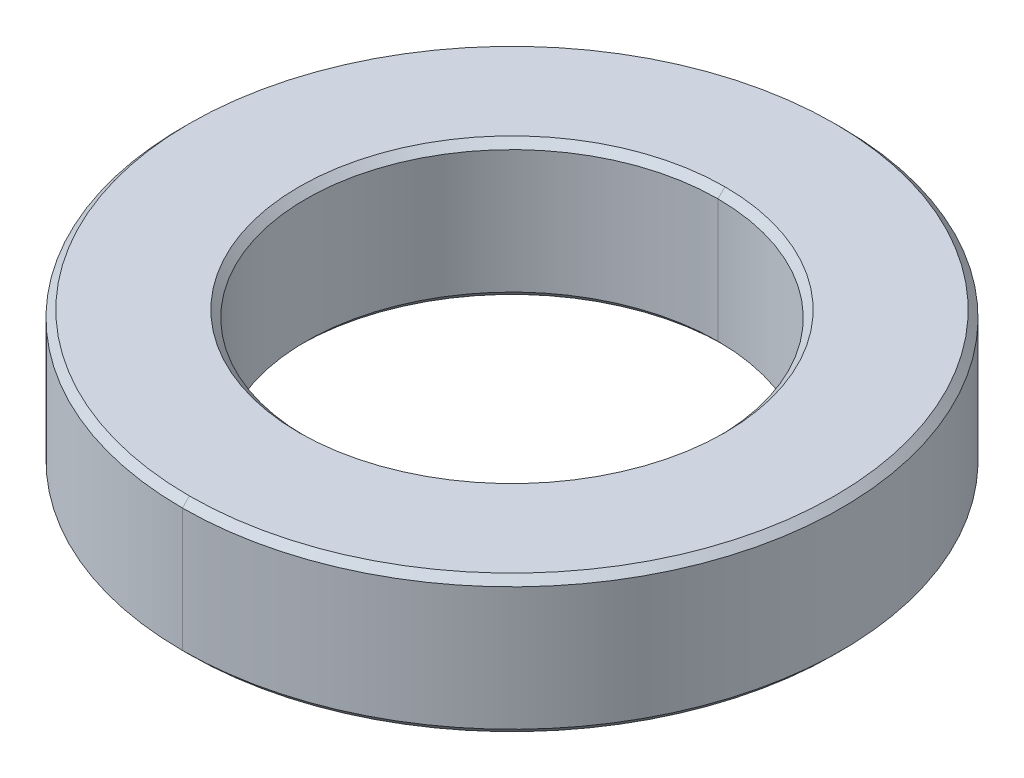
ISO-10303-21;
HEADER;
FILE_DESCRIPTION(('STEP AP214'),'2;1');
FILE_NAME('part.step','',(''),(''),'','','');
FILE_SCHEMA(('AUTOMOTIVE_DESIGN { 1 0 10303 214 1 1 1 1 }'));
ENDSEC;
DATA;
#1=APPLICATION_CONTEXT('core data for automotive mechanical design processes');
#2=APPLICATION_PROTOCOL_DEFINITION('international standard','automotive_design',2000,#1);
#3=PRODUCT_CONTEXT('',#1,'mechanical');
#4=PRODUCT('Part','Part','',(#3));
#5=PRODUCT_RELATED_PRODUCT_CATEGORY('part','',(#4));
#6=PRODUCT_DEFINITION_FORMATION('','',#4);
#7=PRODUCT_DEFINITION_CONTEXT('part definition',#1,'design');
#8=PRODUCT_DEFINITION('design','',#6,#7);
#9=PRODUCT_DEFINITION_SHAPE('','',#8);
#10=(LENGTH_UNIT() NAMED_UNIT(*) SI_UNIT(.MILLI.,.METRE.));
#11=(NAMED_UNIT(*) PLANE_ANGLE_UNIT() SI_UNIT($,.RADIAN.));
#12=(NAMED_UNIT(*) SI_UNIT($,.STERADIAN.) SOLID_ANGLE_UNIT());
#13=UNCERTAINTY_MEASURE_WITH_UNIT(LENGTH_MEASURE(1.E-05),#10,'distance_accuracy_value','');
#14=(GEOMETRIC_REPRESENTATION_CONTEXT(3) GLOBAL_UNCERTAINTY_ASSIGNED_CONTEXT((#13)) GLOBAL_UNIT_ASSIGNED_CONTEXT((#10,
#11,#12)) REPRESENTATION_CONTEXT('',''));
#15=CARTESIAN_POINT('',(0.,0.,0.));
#16=DIRECTION('',(0.,0.,1.));
#17=DIRECTION('',(1.,0.,0.));
#18=AXIS2_PLACEMENT_3D('',#15,#16,#17);
#19=CARTESIAN_POINT('',(0.,2.499999953,0.));
#20=DIRECTION('',(0.,-1.,0.));
#21=DIRECTION('',(0.,0.,-1.));
#22=AXIS2_PLACEMENT_3D('',#19,#20,#21);
#23=CONICAL_SURFACE('',#22,11.746000003,0.785398163397435);
#24=DIRECTION('',(0.,-0.707106781186557,0.707106781186538));
#25=VECTOR('',#24,1.);
#26=CARTESIAN_POINT('',(0.,2.499999953,11.746000003));
#27=LINE('',#26,#25);
#28=CARTESIAN_POINT('',(0.,2.499999953,11.746000003));
#29=VERTEX_POINT('',#28);
#30=CARTESIAN_POINT('',(0.,2.245999953,12.000000003));
#31=VERTEX_POINT('',#30);
#32=EDGE_CURVE('E189',#29,#31,#27,.T.);
#33=ORIENTED_EDGE('',*,*,#32,.F.);
#34=CARTESIAN_POINT('',(0.,2.499999953,0.));
#35=DIRECTION('',(0.,1.,0.));
#36=DIRECTION('',(0.,0.,1.));
#37=AXIS2_PLACEMENT_3D('',#34,#35,#36);
#38=CIRCLE('',#37,11.746000003);
#39=CARTESIAN_POINT('',(0.,2.499999953,-11.746000003));
#40=VERTEX_POINT('',#39);
#41=EDGE_CURVE('E178',#40,#29,#38,.T.);
#42=ORIENTED_EDGE('',*,*,#41,.F.);
#43=DIRECTION('',(0.,-0.707106781186557,-0.707106781186538));
#44=VECTOR('',#43,1.);
#45=CARTESIAN_POINT('',(0.,2.499999953,-11.746000003));
#46=LINE('',#45,#44);
#47=CARTESIAN_POINT('',(0.,2.245999953,-12.000000003));
#48=VERTEX_POINT('',#47);
#49=EDGE_CURVE('E181',#40,#48,#46,.T.);
#50=ORIENTED_EDGE('',*,*,#49,.T.);
#51=CARTESIAN_POINT('',(0.,2.245999953,0.));
#52=DIRECTION('',(0.,-1.,0.));
#53=DIRECTION('',(0.,0.,1.));
#54=AXIS2_PLACEMENT_3D('',#51,#52,#53);
#55=CIRCLE('',#54,12.000000003);
#56=EDGE_CURVE('E110',#31,#48,#55,.T.);
#57=ORIENTED_EDGE('',*,*,#56,.F.);
#58=EDGE_LOOP('',(#33,#42,#50,#57));
#59=FACE_BOUND('',#58,.T.);
#60=ADVANCED_FACE('F16',(#59),#23,.T.);
#61=CARTESIAN_POINT('',(0.,2.24599995299999,0.));
#62=DIRECTION('',(0.,1.,0.));
#63=DIRECTION('',(0.,0.,1.));
#64=AXIS2_PLACEMENT_3D('',#61,#62,#63);
#65=CONICAL_SURFACE('',#64,7.499999986,0.785398163397452);
#66=DIRECTION('',(0.,0.707106781186545,-0.70710678118655));
#67=VECTOR('',#66,1.);
#68=CARTESIAN_POINT('',(0.,2.24599995299999,-7.499999986));
#69=LINE('',#68,#67);
#70=CARTESIAN_POINT('',(0.,2.24599995299999,-7.499999986));
#71=VERTEX_POINT('',#70);
#72=CARTESIAN_POINT('',(0.,2.499999953,-7.75399998600001));
#73=VERTEX_POINT('',#72);
#74=EDGE_CURVE('E203',#71,#73,#69,.T.);
#75=ORIENTED_EDGE('',*,*,#74,.F.);
#76=CARTESIAN_POINT('',(0.,2.24599995299999,0.));
#77=DIRECTION('',(0.,1.,0.));
#78=DIRECTION('',(0.,0.,1.));
#79=AXIS2_PLACEMENT_3D('',#76,#77,#78);
#80=CIRCLE('',#79,7.499999986);
#81=CARTESIAN_POINT('',(0.,2.24599995299999,7.499999986));
#82=VERTEX_POINT('',#81);
#83=EDGE_CURVE('E26',#82,#71,#80,.T.);
#84=ORIENTED_EDGE('',*,*,#83,.F.);
#85=DIRECTION('',(0.,0.707106781186545,0.70710678118655));
#86=VECTOR('',#85,1.);
#87=CARTESIAN_POINT('',(0.,2.24599995299999,7.499999986));
#88=LINE('',#87,#86);
#89=CARTESIAN_POINT('',(0.,2.499999953,7.75399998600001));
#90=VERTEX_POINT('',#89);
#91=EDGE_CURVE('E202',#82,#90,#88,.T.);
#92=ORIENTED_EDGE('',*,*,#91,.T.);
#93=CARTESIAN_POINT('',(0.,2.499999953,0.));
#94=DIRECTION('',(0.,-1.,0.));
#95=DIRECTION('',(0.,0.,1.));
#96=AXIS2_PLACEMENT_3D('',#93,#94,#95);
#97=CIRCLE('',#96,7.75399998600001);
#98=EDGE_CURVE('E146',#73,#90,#97,.T.);
#99=ORIENTED_EDGE('',*,*,#98,.F.);
#100=EDGE_LOOP('',(#75,#84,#92,#99));
#101=FACE_BOUND('',#100,.T.);
#102=ADVANCED_FACE('F242',(#101),#65,.F.);
#103=CARTESIAN_POINT('',(0.,-2.24599995299999,0.));
#104=DIRECTION('',(0.,1.,0.));
#105=DIRECTION('',(0.,0.,1.));
#106=AXIS2_PLACEMENT_3D('',#103,#104,#105);
#107=CONICAL_SURFACE('',#106,12.000000003,0.785398163397448);
#108=DIRECTION('',(0.,0.707106781186548,-0.707106781186548));
#109=VECTOR('',#108,1.);
#110=CARTESIAN_POINT('',(0.,-2.24599995299999,-12.000000003));
#111=LINE('',#110,#109);
#112=CARTESIAN_POINT('',(0.,-2.499999953,-11.746000003));
#113=VERTEX_POINT('',#112);
#114=CARTESIAN_POINT('',(0.,-2.24599995299999,-12.000000003));
#115=VERTEX_POINT('',#114);
#116=EDGE_CURVE('E133',#113,#115,#111,.T.);
#117=ORIENTED_EDGE('',*,*,#116,.F.);
#118=CARTESIAN_POINT('',(0.,-2.499999953,0.));
#119=DIRECTION('',(0.,-1.,0.));
#120=DIRECTION('',(0.,0.,1.));
#121=AXIS2_PLACEMENT_3D('',#118,#119,#120);
#122=CIRCLE('',#121,11.746000003);
#123=CARTESIAN_POINT('',(0.,-2.499999953,11.746000003));
#124=VERTEX_POINT('',#123);
#125=EDGE_CURVE('E125',#124,#113,#122,.T.);
#126=ORIENTED_EDGE('',*,*,#125,.F.);
#127=DIRECTION('',(0.,0.707106781186548,0.707106781186548));
#128=VECTOR('',#127,1.);
#129=CARTESIAN_POINT('',(0.,-2.24599995299999,12.000000003));
#130=LINE('',#129,#128);
#131=CARTESIAN_POINT('',(0.,-2.24599995299999,12.000000003));
#132=VERTEX_POINT('',#131);
#133=EDGE_CURVE('E123',#124,#132,#130,.T.);
#134=ORIENTED_EDGE('',*,*,#133,.T.);
#135=CARTESIAN_POINT('',(0.,-2.24599995299999,0.));
#136=DIRECTION('',(0.,1.,0.));
#137=DIRECTION('',(0.,0.,1.));
#138=AXIS2_PLACEMENT_3D('',#135,#136,#137);
#139=CIRCLE('',#138,12.000000003);
#140=EDGE_CURVE('E98',#115,#132,#139,.T.);
#141=ORIENTED_EDGE('',*,*,#140,.F.);
#142=EDGE_LOOP('',(#117,#126,#134,#141));
#143=FACE_BOUND('',#142,.T.);
#144=ADVANCED_FACE('F124',(#143),#107,.T.);
#145=CARTESIAN_POINT('',(0.,-2.499999953,0.));
#146=DIRECTION('',(0.,-1.,0.));
#147=DIRECTION('',(0.,0.,-1.));
#148=AXIS2_PLACEMENT_3D('',#145,#146,#147);
#149=CONICAL_SURFACE('',#148,7.753999986,0.785398163397445);
#150=DIRECTION('',(0.,-0.70710678118655,0.707106781186545));
#151=VECTOR('',#150,1.);
#152=CARTESIAN_POINT('',(0.,-2.499999953,7.753999986));
#153=LINE('',#152,#151);
#154=CARTESIAN_POINT('',(0.,-2.245999953,7.499999986));
#155=VERTEX_POINT('',#154);
#156=CARTESIAN_POINT('',(0.,-2.499999953,7.753999986));
#157=VERTEX_POINT('',#156);
#158=EDGE_CURVE('E160',#155,#157,#153,.T.);
#159=ORIENTED_EDGE('',*,*,#158,.F.);
#160=CARTESIAN_POINT('',(0.,-2.245999953,0.));
#161=DIRECTION('',(0.,-1.,0.));
#162=DIRECTION('',(0.,0.,1.));
#163=AXIS2_PLACEMENT_3D('',#160,#161,#162);
#164=CIRCLE('',#163,7.499999986);
#165=CARTESIAN_POINT('',(0.,-2.245999953,-7.499999986));
#166=VERTEX_POINT('',#165);
#167=EDGE_CURVE('E11',#166,#155,#164,.T.);
#168=ORIENTED_EDGE('',*,*,#167,.F.);
#169=DIRECTION('',(0.,-0.70710678118655,-0.707106781186545));
#170=VECTOR('',#169,1.);
#171=CARTESIAN_POINT('',(0.,-2.499999953,-7.753999986));
#172=LINE('',#171,#170);
#173=CARTESIAN_POINT('',(0.,-2.499999953,-7.753999986));
#174=VERTEX_POINT('',#173);
#175=EDGE_CURVE('E147',#166,#174,#172,.T.);
#176=ORIENTED_EDGE('',*,*,#175,.T.);
#177=CARTESIAN_POINT('',(0.,-2.499999953,0.));
#178=DIRECTION('',(0.,1.,0.));
#179=DIRECTION('',(0.,0.,1.));
#180=AXIS2_PLACEMENT_3D('',#177,#178,#179);
#181=CIRCLE('',#180,7.753999986);
#182=EDGE_CURVE('E39',#157,#174,#181,.T.);
#183=ORIENTED_EDGE('',*,*,#182,.F.);
#184=EDGE_LOOP('',(#159,#168,#176,#183));
#185=FACE_BOUND('',#184,.T.);
#186=ADVANCED_FACE('F251',(#185),#149,.F.);
#187=CARTESIAN_POINT('',(0.,2.499999953,0.));
#188=DIRECTION('',(0.,-1.,0.));
#189=DIRECTION('',(0.,0.,-1.));
#190=AXIS2_PLACEMENT_3D('',#187,#188,#189);
#191=CYLINDRICAL_SURFACE('',#190,7.499999986);
#192=DIRECTION('',(0.,-1.,0.));
#193=VECTOR('',#192,1.);
#194=CARTESIAN_POINT('',(0.,2.499999953,7.499999986));
#195=LINE('',#194,#193);
#196=EDGE_CURVE('E149',#82,#155,#195,.T.);
#197=ORIENTED_EDGE('',*,*,#196,.F.);
#198=ORIENTED_EDGE('',*,*,#83,.T.);
#199=DIRECTION('',(0.,-1.,0.));
#200=VECTOR('',#199,1.);
#201=CARTESIAN_POINT('',(0.,2.499999953,-7.499999986));
#202=LINE('',#201,#200);
#203=EDGE_CURVE('E19',#71,#166,#202,.T.);
#204=ORIENTED_EDGE('',*,*,#203,.T.);
#205=ORIENTED_EDGE('',*,*,#167,.T.);
#206=EDGE_LOOP('',(#197,#198,#204,#205));
#207=FACE_BOUND('',#206,.T.);
#208=ADVANCED_FACE('F258',(#207),#191,.F.);
#209=CARTESIAN_POINT('',(0.,2.499999953,0.));
#210=DIRECTION('',(0.,-1.,0.));
#211=DIRECTION('',(0.,0.,-1.));
#212=AXIS2_PLACEMENT_3D('',#209,#210,#211);
#213=CYLINDRICAL_SURFACE('',#212,12.000000003);
#214=DIRECTION('',(0.,-1.,0.));
#215=VECTOR('',#214,1.);
#216=CARTESIAN_POINT('',(0.,2.499999953,12.000000003));
#217=LINE('',#216,#215);
#218=EDGE_CURVE('E101',#31,#132,#217,.T.);
#219=ORIENTED_EDGE('',*,*,#218,.F.);
#220=ORIENTED_EDGE('',*,*,#56,.T.);
#221=DIRECTION('',(0.,-1.,0.));
#222=VECTOR('',#221,1.);
#223=CARTESIAN_POINT('',(0.,2.499999953,-12.000000003));
#224=LINE('',#223,#222);
#225=EDGE_CURVE('E104',#48,#115,#224,.T.);
#226=ORIENTED_EDGE('',*,*,#225,.T.);
#227=ORIENTED_EDGE('',*,*,#140,.T.);
#228=EDGE_LOOP('',(#219,#220,#226,#227));
#229=FACE_BOUND('',#228,.T.);
#230=ADVANCED_FACE('F100',(#229),#213,.T.);
#231=CARTESIAN_POINT('',(0.,-2.499999953,0.));
#232=DIRECTION('',(0.,1.,0.));
#233=DIRECTION('',(1.,0.,0.));
#234=AXIS2_PLACEMENT_3D('',#231,#232,#233);
#235=PLANE('',#234);
#236=CARTESIAN_POINT('',(0.,-2.499999953,0.));
#237=DIRECTION('',(0.,1.,0.));
#238=DIRECTION('',(0.,0.,1.));
#239=AXIS2_PLACEMENT_3D('',#236,#237,#238);
#240=CIRCLE('',#239,7.753999986);
#241=EDGE_CURVE('E150',#174,#157,#240,.T.);
#242=ORIENTED_EDGE('',*,*,#241,.T.);
#243=ORIENTED_EDGE('',*,*,#182,.T.);
#244=EDGE_LOOP('',(#242,#243));
#245=FACE_BOUND('',#244,.T.);
#246=ORIENTED_EDGE('',*,*,#125,.T.);
#247=CARTESIAN_POINT('',(0.,-2.499999953,0.));
#248=DIRECTION('',(0.,-1.,0.));
#249=DIRECTION('',(0.,0.,1.));
#250=AXIS2_PLACEMENT_3D('',#247,#248,#249);
#251=CIRCLE('',#250,11.746000003);
#252=EDGE_CURVE('E140',#113,#124,#251,.T.);
#253=ORIENTED_EDGE('',*,*,#252,.T.);
#254=EDGE_LOOP('',(#246,#253));
#255=FACE_BOUND('',#254,.T.);
#256=ADVANCED_FACE('F228',(#245,#255),#235,.F.);
#257=CARTESIAN_POINT('',(0.,2.499999953,0.));
#258=DIRECTION('',(0.,1.,0.));
#259=DIRECTION('',(1.,0.,0.));
#260=AXIS2_PLACEMENT_3D('',#257,#258,#259);
#261=PLANE('',#260);
#262=CARTESIAN_POINT('',(0.,2.499999953,0.));
#263=DIRECTION('',(0.,-1.,0.));
#264=DIRECTION('',(0.,0.,1.));
#265=AXIS2_PLACEMENT_3D('',#262,#263,#264);
#266=CIRCLE('',#265,7.75399998600001);
#267=EDGE_CURVE('E199',#90,#73,#266,.T.);
#268=ORIENTED_EDGE('',*,*,#267,.T.);
#269=ORIENTED_EDGE('',*,*,#98,.T.);
#270=EDGE_LOOP('',(#268,#269));
#271=FACE_BOUND('',#270,.T.);
#272=ORIENTED_EDGE('',*,*,#41,.T.);
#273=CARTESIAN_POINT('',(0.,2.499999953,0.));
#274=DIRECTION('',(0.,1.,0.));
#275=DIRECTION('',(0.,0.,1.));
#276=AXIS2_PLACEMENT_3D('',#273,#274,#275);
#277=CIRCLE('',#276,11.746000003);
#278=EDGE_CURVE('E195',#29,#40,#277,.T.);
#279=ORIENTED_EDGE('',*,*,#278,.T.);
#280=EDGE_LOOP('',(#272,#279));
#281=FACE_BOUND('',#280,.T.);
#282=ADVANCED_FACE('F226',(#271,#281),#261,.T.);
#283=CARTESIAN_POINT('',(0.,2.499999953,0.));
#284=DIRECTION('',(0.,-1.,0.));
#285=DIRECTION('',(0.,0.,-1.));
#286=AXIS2_PLACEMENT_3D('',#283,#284,#285);
#287=CYLINDRICAL_SURFACE('',#286,12.000000003);
#288=CARTESIAN_POINT('',(0.,2.245999953,0.));
#289=DIRECTION('',(0.,-1.,0.));
#290=DIRECTION('',(0.,0.,1.));
#291=AXIS2_PLACEMENT_3D('',#288,#289,#290);
#292=CIRCLE('',#291,12.000000003);
#293=EDGE_CURVE('E118',#48,#31,#292,.T.);
#294=ORIENTED_EDGE('',*,*,#293,.T.);
#295=ORIENTED_EDGE('',*,*,#218,.T.);
#296=CARTESIAN_POINT('',(0.,-2.24599995299999,0.));
#297=DIRECTION('',(0.,1.,0.));
#298=DIRECTION('',(0.,0.,1.));
#299=AXIS2_PLACEMENT_3D('',#296,#297,#298);
#300=CIRCLE('',#299,12.000000003);
#301=EDGE_CURVE('E115',#132,#115,#300,.T.);
#302=ORIENTED_EDGE('',*,*,#301,.T.);
#303=ORIENTED_EDGE('',*,*,#225,.F.);
#304=EDGE_LOOP('',(#294,#295,#302,#303));
#305=FACE_BOUND('',#304,.T.);
#306=ADVANCED_FACE('F113',(#305),#287,.T.);
#307=CARTESIAN_POINT('',(0.,2.499999953,0.));
#308=DIRECTION('',(0.,-1.,0.));
#309=DIRECTION('',(0.,0.,-1.));
#310=AXIS2_PLACEMENT_3D('',#307,#308,#309);
#311=CYLINDRICAL_SURFACE('',#310,7.499999986);
#312=CARTESIAN_POINT('',(0.,2.24599995299999,0.));
#313=DIRECTION('',(0.,1.,0.));
#314=DIRECTION('',(0.,0.,1.));
#315=AXIS2_PLACEMENT_3D('',#312,#313,#314);
#316=CIRCLE('',#315,7.499999986);
#317=EDGE_CURVE('E186',#71,#82,#316,.T.);
#318=ORIENTED_EDGE('',*,*,#317,.T.);
#319=ORIENTED_EDGE('',*,*,#196,.T.);
#320=CARTESIAN_POINT('',(0.,-2.245999953,0.));
#321=DIRECTION('',(0.,-1.,0.));
#322=DIRECTION('',(0.,0.,1.));
#323=AXIS2_PLACEMENT_3D('',#320,#321,#322);
#324=CIRCLE('',#323,7.499999986);
#325=EDGE_CURVE('E130',#155,#166,#324,.T.);
#326=ORIENTED_EDGE('',*,*,#325,.T.);
#327=ORIENTED_EDGE('',*,*,#203,.F.);
#328=EDGE_LOOP('',(#318,#319,#326,#327));
#329=FACE_BOUND('',#328,.T.);
#330=ADVANCED_FACE('F236',(#329),#311,.F.);
#331=CARTESIAN_POINT('',(0.,-2.499999953,0.));
#332=DIRECTION('',(0.,-1.,0.));
#333=DIRECTION('',(0.,0.,-1.));
#334=AXIS2_PLACEMENT_3D('',#331,#332,#333);
#335=CONICAL_SURFACE('',#334,7.753999986,0.785398163397445);
#336=ORIENTED_EDGE('',*,*,#325,.F.);
#337=ORIENTED_EDGE('',*,*,#158,.T.);
#338=ORIENTED_EDGE('',*,*,#241,.F.);
#339=ORIENTED_EDGE('',*,*,#175,.F.);
#340=EDGE_LOOP('',(#336,#337,#338,#339));
#341=FACE_BOUND('',#340,.T.);
#342=ADVANCED_FACE('F256',(#341),#335,.F.);
#343=CARTESIAN_POINT('',(0.,-2.24599995299999,0.));
#344=DIRECTION('',(0.,1.,0.));
#345=DIRECTION('',(0.,0.,1.));
#346=AXIS2_PLACEMENT_3D('',#343,#344,#345);
#347=CONICAL_SURFACE('',#346,12.000000003,0.785398163397448);
#348=ORIENTED_EDGE('',*,*,#252,.F.);
#349=ORIENTED_EDGE('',*,*,#116,.T.);
#350=ORIENTED_EDGE('',*,*,#301,.F.);
#351=ORIENTED_EDGE('',*,*,#133,.F.);
#352=EDGE_LOOP('',(#348,#349,#350,#351));
#353=FACE_BOUND('',#352,.T.);
#354=ADVANCED_FACE('F132',(#353),#347,.T.);
#355=CARTESIAN_POINT('',(0.,2.24599995299999,0.));
#356=DIRECTION('',(0.,1.,0.));
#357=DIRECTION('',(0.,0.,1.));
#358=AXIS2_PLACEMENT_3D('',#355,#356,#357);
#359=CONICAL_SURFACE('',#358,7.499999986,0.785398163397452);
#360=ORIENTED_EDGE('',*,*,#317,.F.);
#361=ORIENTED_EDGE('',*,*,#74,.T.);
#362=ORIENTED_EDGE('',*,*,#267,.F.);
#363=ORIENTED_EDGE('',*,*,#91,.F.);
#364=EDGE_LOOP('',(#360,#361,#362,#363));
#365=FACE_BOUND('',#364,.T.);
#366=ADVANCED_FACE('F263',(#365),#359,.F.);
#367=CARTESIAN_POINT('',(0.,2.499999953,0.));
#368=DIRECTION('',(0.,-1.,0.));
#369=DIRECTION('',(0.,0.,-1.));
#370=AXIS2_PLACEMENT_3D('',#367,#368,#369);
#371=CONICAL_SURFACE('',#370,11.746000003,0.785398163397435);
#372=ORIENTED_EDGE('',*,*,#278,.F.);
#373=ORIENTED_EDGE('',*,*,#32,.T.);
#374=ORIENTED_EDGE('',*,*,#293,.F.);
#375=ORIENTED_EDGE('',*,*,#49,.F.);
#376=EDGE_LOOP('',(#372,#373,#374,#375));
#377=FACE_BOUND('',#376,.T.);
#378=ADVANCED_FACE('F188',(#377),#371,.T.);
#379=CLOSED_SHELL('',(#60,#102,#144,#186,#208,#230,#256,#282,#306,#330,#342,#354,#366,#378));
#380=MANIFOLD_SOLID_BREP('B1',#379);
#381=ADVANCED_BREP_SHAPE_REPRESENTATION('',(#18,#380),#14);
#382=SHAPE_DEFINITION_REPRESENTATION(#9,#381);
ENDSEC;
END-ISO-10303-21;
